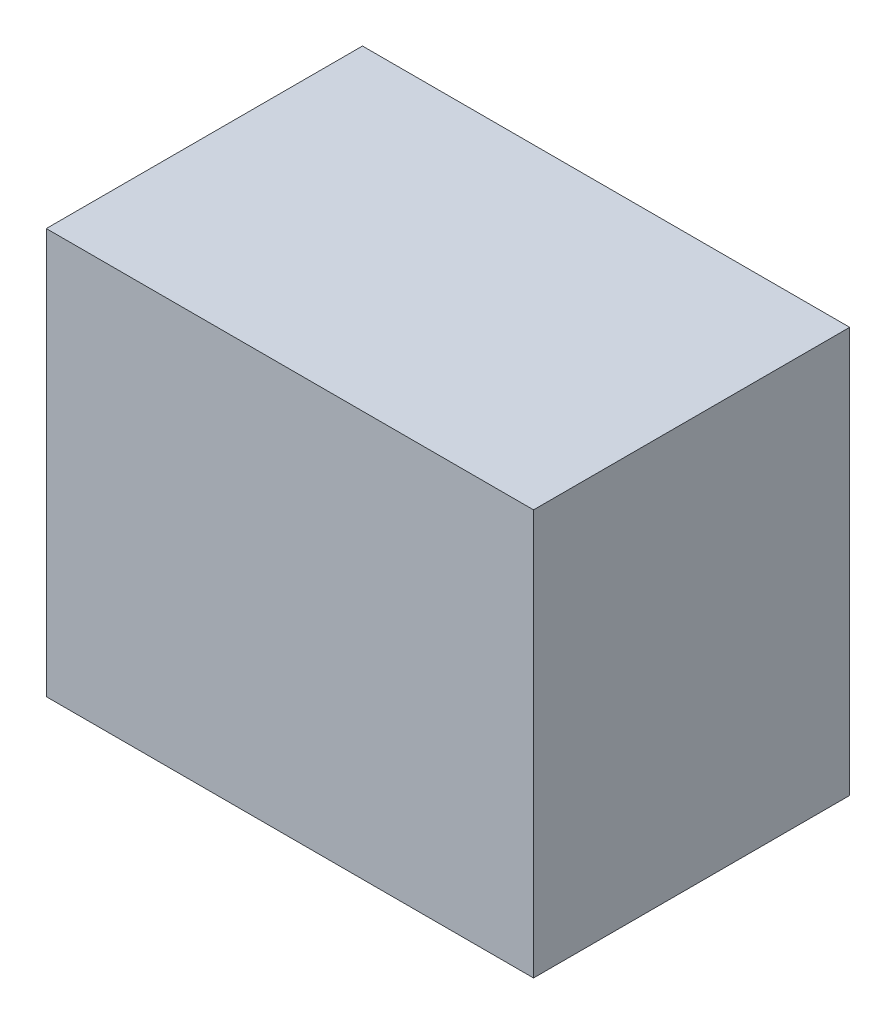
ISO-10303-21;
HEADER;
FILE_DESCRIPTION(('STEP AP214'),'2;1');
FILE_NAME('part.step','',(''),(''),'','','');
FILE_SCHEMA(('AUTOMOTIVE_DESIGN { 1 0 10303 214 1 1 1 1 }'));
ENDSEC;
DATA;
#1=APPLICATION_CONTEXT('core data for automotive mechanical design processes');
#2=APPLICATION_PROTOCOL_DEFINITION('international standard','automotive_design',2000,#1);
#3=PRODUCT_CONTEXT('',#1,'mechanical');
#4=PRODUCT('Part','Part','',(#3));
#5=PRODUCT_RELATED_PRODUCT_CATEGORY('part','',(#4));
#6=PRODUCT_DEFINITION_FORMATION('','',#4);
#7=PRODUCT_DEFINITION_CONTEXT('part definition',#1,'design');
#8=PRODUCT_DEFINITION('design','',#6,#7);
#9=PRODUCT_DEFINITION_SHAPE('','',#8);
#10=(LENGTH_UNIT() NAMED_UNIT(*) SI_UNIT(.MILLI.,.METRE.));
#11=(NAMED_UNIT(*) PLANE_ANGLE_UNIT() SI_UNIT($,.RADIAN.));
#12=(NAMED_UNIT(*) SI_UNIT($,.STERADIAN.) SOLID_ANGLE_UNIT());
#13=UNCERTAINTY_MEASURE_WITH_UNIT(LENGTH_MEASURE(1.E-05),#10,'distance_accuracy_value','');
#14=(GEOMETRIC_REPRESENTATION_CONTEXT(3) GLOBAL_UNCERTAINTY_ASSIGNED_CONTEXT((#13)) GLOBAL_UNIT_ASSIGNED_CONTEXT((#10,
#11,#12)) REPRESENTATION_CONTEXT('',''));
#15=CARTESIAN_POINT('',(0.,0.,0.));
#16=DIRECTION('',(0.,0.,1.));
#17=DIRECTION('',(1.,0.,0.));
#18=AXIS2_PLACEMENT_3D('',#15,#16,#17);
#19=CARTESIAN_POINT('',(32.4422051793356,-23.9751461352782,31.));
#20=DIRECTION('',(-1.,0.,0.));
#21=DIRECTION('',(0.,0.,1.));
#22=AXIS2_PLACEMENT_3D('',#19,#20,#21);
#23=PLANE('',#22);
#24=DIRECTION('',(0.,1.,0.));
#25=VECTOR('',#24,1.);
#26=CARTESIAN_POINT('',(32.4422051793356,-23.9751461352782,0.));
#27=LINE('',#26,#25);
#28=CARTESIAN_POINT('',(32.4422051793356,-23.9751461352782,0.));
#29=VERTEX_POINT('',#28);
#30=CARTESIAN_POINT('',(32.4422051793356,15.7754679031384,0.));
#31=VERTEX_POINT('',#30);
#32=EDGE_CURVE('E96',#29,#31,#27,.T.);
#33=ORIENTED_EDGE('',*,*,#32,.T.);
#34=DIRECTION('',(0.,0.,-1.));
#35=VECTOR('',#34,1.);
#36=CARTESIAN_POINT('',(32.4422051793356,15.7754679031384,31.));
#37=LINE('',#36,#35);
#38=CARTESIAN_POINT('',(32.4422051793356,15.7754679031384,31.));
#39=VERTEX_POINT('',#38);
#40=EDGE_CURVE('E11',#39,#31,#37,.T.);
#41=ORIENTED_EDGE('',*,*,#40,.F.);
#42=DIRECTION('',(0.,1.,0.));
#43=VECTOR('',#42,1.);
#44=CARTESIAN_POINT('',(32.4422051793356,-23.9751461352782,31.));
#45=LINE('',#44,#43);
#46=CARTESIAN_POINT('',(32.4422051793356,-23.9751461352782,31.));
#47=VERTEX_POINT('',#46);
#48=EDGE_CURVE('E84',#47,#39,#45,.T.);
#49=ORIENTED_EDGE('',*,*,#48,.F.);
#50=DIRECTION('',(0.,0.,-1.));
#51=VECTOR('',#50,1.);
#52=CARTESIAN_POINT('',(32.4422051793356,-23.9751461352782,31.));
#53=LINE('',#52,#51);
#54=EDGE_CURVE('E92',#47,#29,#53,.T.);
#55=ORIENTED_EDGE('',*,*,#54,.T.);
#56=EDGE_LOOP('',(#33,#41,#49,#55));
#57=FACE_BOUND('',#56,.T.);
#58=ADVANCED_FACE('F33',(#57),#23,.F.);
#59=CARTESIAN_POINT('',(32.4422051793356,15.7754679031384,31.));
#60=DIRECTION('',(0.,-1.,0.));
#61=DIRECTION('',(0.,0.,-1.));
#62=AXIS2_PLACEMENT_3D('',#59,#60,#61);
#63=PLANE('',#62);
#64=DIRECTION('',(-1.,0.,0.));
#65=VECTOR('',#64,1.);
#66=CARTESIAN_POINT('',(32.4422051793356,15.7754679031384,0.));
#67=LINE('',#66,#65);
#68=CARTESIAN_POINT('',(-15.3298332166091,15.7754679031384,0.));
#69=VERTEX_POINT('',#68);
#70=EDGE_CURVE('E88',#31,#69,#67,.T.);
#71=ORIENTED_EDGE('',*,*,#70,.T.);
#72=DIRECTION('',(0.,0.,-1.));
#73=VECTOR('',#72,1.);
#74=CARTESIAN_POINT('',(-15.3298332166091,15.7754679031384,31.));
#75=LINE('',#74,#73);
#76=CARTESIAN_POINT('',(-15.3298332166091,15.7754679031384,31.));
#77=VERTEX_POINT('',#76);
#78=EDGE_CURVE('E41',#77,#69,#75,.T.);
#79=ORIENTED_EDGE('',*,*,#78,.F.);
#80=DIRECTION('',(-1.,0.,0.));
#81=VECTOR('',#80,1.);
#82=CARTESIAN_POINT('',(32.4422051793356,15.7754679031384,31.));
#83=LINE('',#82,#81);
#84=EDGE_CURVE('E79',#39,#77,#83,.T.);
#85=ORIENTED_EDGE('',*,*,#84,.F.);
#86=ORIENTED_EDGE('',*,*,#40,.T.);
#87=EDGE_LOOP('',(#71,#79,#85,#86));
#88=FACE_BOUND('',#87,.T.);
#89=ADVANCED_FACE('F87',(#88),#63,.F.);
#90=CARTESIAN_POINT('',(-15.3298332166091,-23.9751461352782,31.));
#91=DIRECTION('',(1.,0.,0.));
#92=DIRECTION('',(0.,0.,-1.));
#93=AXIS2_PLACEMENT_3D('',#90,#91,#92);
#94=PLANE('',#93);
#95=DIRECTION('',(0.,-1.,0.));
#96=VECTOR('',#95,1.);
#97=CARTESIAN_POINT('',(-15.3298332166091,-23.9751461352782,0.));
#98=LINE('',#97,#96);
#99=CARTESIAN_POINT('',(-15.3298332166091,-23.9751461352782,0.));
#100=VERTEX_POINT('',#99);
#101=EDGE_CURVE('E66',#69,#100,#98,.T.);
#102=ORIENTED_EDGE('',*,*,#101,.T.);
#103=DIRECTION('',(0.,0.,-1.));
#104=VECTOR('',#103,1.);
#105=CARTESIAN_POINT('',(-15.3298332166091,-23.9751461352782,31.));
#106=LINE('',#105,#104);
#107=CARTESIAN_POINT('',(-15.3298332166091,-23.9751461352782,31.));
#108=VERTEX_POINT('',#107);
#109=EDGE_CURVE('E89',#108,#100,#106,.T.);
#110=ORIENTED_EDGE('',*,*,#109,.F.);
#111=DIRECTION('',(0.,-1.,0.));
#112=VECTOR('',#111,1.);
#113=CARTESIAN_POINT('',(-15.3298332166091,-23.9751461352782,31.));
#114=LINE('',#113,#112);
#115=EDGE_CURVE('E82',#77,#108,#114,.T.);
#116=ORIENTED_EDGE('',*,*,#115,.F.);
#117=ORIENTED_EDGE('',*,*,#78,.T.);
#118=EDGE_LOOP('',(#102,#110,#116,#117));
#119=FACE_BOUND('',#118,.T.);
#120=ADVANCED_FACE('F90',(#119),#94,.F.);
#121=CARTESIAN_POINT('',(32.4422051793356,-23.9751461352782,31.));
#122=DIRECTION('',(0.,1.,0.));
#123=DIRECTION('',(0.,0.,1.));
#124=AXIS2_PLACEMENT_3D('',#121,#122,#123);
#125=PLANE('',#124);
#126=DIRECTION('',(1.,0.,0.));
#127=VECTOR('',#126,1.);
#128=CARTESIAN_POINT('',(32.4422051793356,-23.9751461352782,0.));
#129=LINE('',#128,#127);
#130=EDGE_CURVE('E72',#100,#29,#129,.T.);
#131=ORIENTED_EDGE('',*,*,#130,.T.);
#132=ORIENTED_EDGE('',*,*,#54,.F.);
#133=DIRECTION('',(1.,0.,0.));
#134=VECTOR('',#133,1.);
#135=CARTESIAN_POINT('',(32.4422051793356,-23.9751461352782,31.));
#136=LINE('',#135,#134);
#137=EDGE_CURVE('E49',#108,#47,#136,.T.);
#138=ORIENTED_EDGE('',*,*,#137,.F.);
#139=ORIENTED_EDGE('',*,*,#109,.T.);
#140=EDGE_LOOP('',(#131,#132,#138,#139));
#141=FACE_BOUND('',#140,.T.);
#142=ADVANCED_FACE('F103',(#141),#125,.F.);
#143=CARTESIAN_POINT('',(0.,0.,31.));
#144=DIRECTION('',(0.,0.,1.));
#145=DIRECTION('',(1.,0.,0.));
#146=AXIS2_PLACEMENT_3D('',#143,#144,#145);
#147=PLANE('',#146);
#148=ORIENTED_EDGE('',*,*,#48,.T.);
#149=ORIENTED_EDGE('',*,*,#84,.T.);
#150=ORIENTED_EDGE('',*,*,#115,.T.);
#151=ORIENTED_EDGE('',*,*,#137,.T.);
#152=EDGE_LOOP('',(#148,#149,#150,#151));
#153=FACE_BOUND('',#152,.T.);
#154=ADVANCED_FACE('F80',(#153),#147,.T.);
#155=CARTESIAN_POINT('',(0.,0.,0.));
#156=DIRECTION('',(0.,0.,1.));
#157=DIRECTION('',(1.,0.,0.));
#158=AXIS2_PLACEMENT_3D('',#155,#156,#157);
#159=PLANE('',#158);
#160=ORIENTED_EDGE('',*,*,#32,.F.);
#161=ORIENTED_EDGE('',*,*,#130,.F.);
#162=ORIENTED_EDGE('',*,*,#101,.F.);
#163=ORIENTED_EDGE('',*,*,#70,.F.);
#164=EDGE_LOOP('',(#160,#161,#162,#163));
#165=FACE_BOUND('',#164,.T.);
#166=ADVANCED_FACE('F106',(#165),#159,.F.);
#167=CLOSED_SHELL('',(#58,#89,#120,#142,#154,#166));
#168=MANIFOLD_SOLID_BREP('B2',#167);
#169=ADVANCED_BREP_SHAPE_REPRESENTATION('',(#18,#168),#14);
#170=SHAPE_DEFINITION_REPRESENTATION(#9,#169);
ENDSEC;
END-ISO-10303-21;
